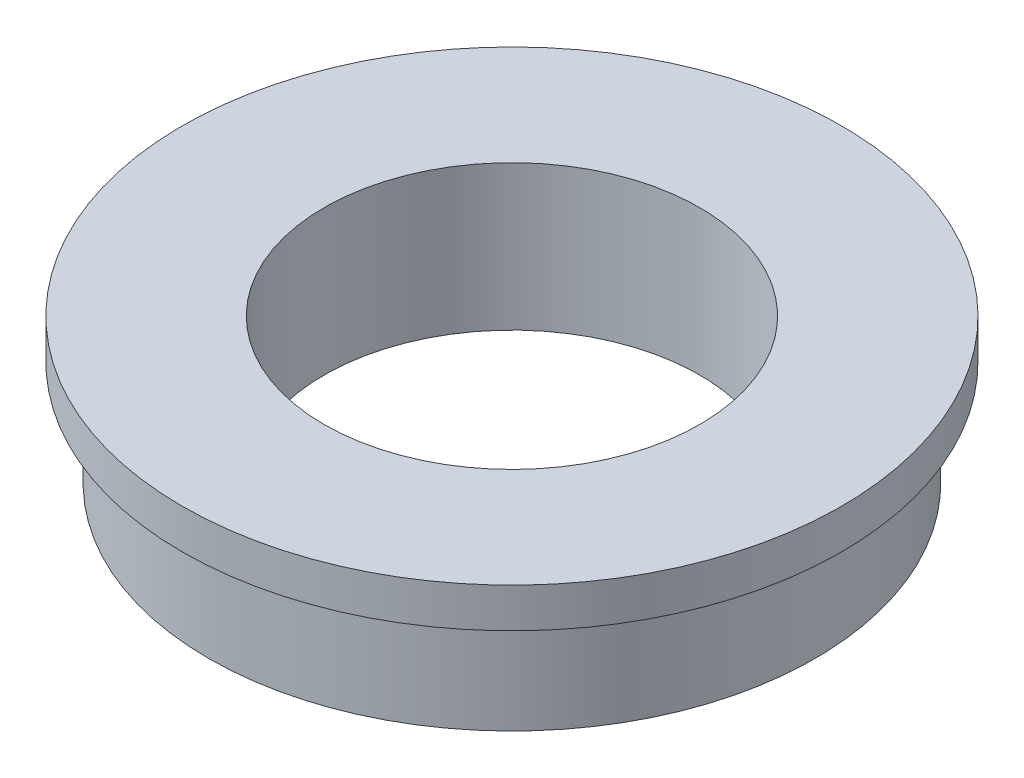
ISO-10303-21;
HEADER;
FILE_DESCRIPTION(('STEP AP214'),'2;1');
FILE_NAME('part.step','',(''),(''),'','','');
FILE_SCHEMA(('AUTOMOTIVE_DESIGN { 1 0 10303 214 1 1 1 1 }'));
ENDSEC;
DATA;
#1=APPLICATION_CONTEXT('core data for automotive mechanical design processes');
#2=APPLICATION_PROTOCOL_DEFINITION('international standard','automotive_design',2000,#1);
#3=PRODUCT_CONTEXT('',#1,'mechanical');
#4=PRODUCT('Part','Part','',(#3));
#5=PRODUCT_RELATED_PRODUCT_CATEGORY('part','',(#4));
#6=PRODUCT_DEFINITION_FORMATION('','',#4);
#7=PRODUCT_DEFINITION_CONTEXT('part definition',#1,'design');
#8=PRODUCT_DEFINITION('design','',#6,#7);
#9=PRODUCT_DEFINITION_SHAPE('','',#8);
#10=(LENGTH_UNIT() NAMED_UNIT(*) SI_UNIT(.MILLI.,.METRE.));
#11=(NAMED_UNIT(*) PLANE_ANGLE_UNIT() SI_UNIT($,.RADIAN.));
#12=(NAMED_UNIT(*) SI_UNIT($,.STERADIAN.) SOLID_ANGLE_UNIT());
#13=UNCERTAINTY_MEASURE_WITH_UNIT(LENGTH_MEASURE(1.E-05),#10,'distance_accuracy_value','');
#14=(GEOMETRIC_REPRESENTATION_CONTEXT(3) GLOBAL_UNCERTAINTY_ASSIGNED_CONTEXT((#13)) GLOBAL_UNIT_ASSIGNED_CONTEXT((#10,
#11,#12)) REPRESENTATION_CONTEXT('',''));
#15=CARTESIAN_POINT('',(0.,0.,0.));
#16=DIRECTION('',(0.,0.,1.));
#17=DIRECTION('',(1.,0.,0.));
#18=AXIS2_PLACEMENT_3D('',#15,#16,#17);
#19=CARTESIAN_POINT('',(-23.,-8.,0.));
#20=DIRECTION('',(0.,-1.,0.));
#21=DIRECTION('',(0.,0.,-1.));
#22=AXIS2_PLACEMENT_3D('',#19,#20,#21);
#23=PLANE('',#22);
#24=CARTESIAN_POINT('',(0.,-8.,0.));
#25=DIRECTION('',(0.,1.,0.));
#26=DIRECTION('',(0.,0.,1.));
#27=AXIS2_PLACEMENT_3D('',#24,#25,#26);
#28=CIRCLE('',#27,14.25);
#29=CARTESIAN_POINT('',(0.,-8.,14.25));
#30=VERTEX_POINT('',#29);
#31=EDGE_CURVE('E10',#30,#30,#28,.T.);
#32=ORIENTED_EDGE('',*,*,#31,.T.);
#33=EDGE_LOOP('',(#32));
#34=FACE_BOUND('',#33,.T.);
#35=CARTESIAN_POINT('',(0.,-8.,0.));
#36=DIRECTION('',(0.,1.,0.));
#37=DIRECTION('',(0.,0.,1.));
#38=AXIS2_PLACEMENT_3D('',#35,#36,#37);
#39=CIRCLE('',#38,23.);
#40=CARTESIAN_POINT('',(0.,-8.,23.));
#41=VERTEX_POINT('',#40);
#42=EDGE_CURVE('E46',#41,#41,#39,.T.);
#43=ORIENTED_EDGE('',*,*,#42,.F.);
#44=EDGE_LOOP('',(#43));
#45=FACE_BOUND('',#44,.T.);
#46=ADVANCED_FACE('F24',(#34,#45),#23,.T.);
#47=CARTESIAN_POINT('',(0.,27.6062610229277,0.));
#48=DIRECTION('',(0.,1.,0.));
#49=DIRECTION('',(0.,0.,1.));
#50=AXIS2_PLACEMENT_3D('',#47,#48,#49);
#51=CYLINDRICAL_SURFACE('',#50,14.25);
#52=CARTESIAN_POINT('',(0.,3.,0.));
#53=DIRECTION('',(0.,1.,0.));
#54=DIRECTION('',(0.,0.,1.));
#55=AXIS2_PLACEMENT_3D('',#52,#53,#54);
#56=CIRCLE('',#55,14.25);
#57=CARTESIAN_POINT('',(0.,3.,14.25));
#58=VERTEX_POINT('',#57);
#59=EDGE_CURVE('E30',#58,#58,#56,.T.);
#60=ORIENTED_EDGE('',*,*,#59,.T.);
#61=EDGE_LOOP('',(#60));
#62=FACE_BOUND('',#61,.T.);
#63=ORIENTED_EDGE('',*,*,#31,.F.);
#64=EDGE_LOOP('',(#63));
#65=FACE_BOUND('',#64,.T.);
#66=ADVANCED_FACE('F54',(#62,#65),#51,.F.);
#67=CARTESIAN_POINT('',(-14.25,3.,0.));
#68=DIRECTION('',(0.,1.,0.));
#69=DIRECTION('',(0.,0.,1.));
#70=AXIS2_PLACEMENT_3D('',#67,#68,#69);
#71=PLANE('',#70);
#72=CARTESIAN_POINT('',(0.,3.,0.));
#73=DIRECTION('',(0.,1.,0.));
#74=DIRECTION('',(0.,0.,1.));
#75=AXIS2_PLACEMENT_3D('',#72,#73,#74);
#76=CIRCLE('',#75,25.);
#77=CARTESIAN_POINT('',(0.,3.,25.));
#78=VERTEX_POINT('',#77);
#79=EDGE_CURVE('E34',#78,#78,#76,.T.);
#80=ORIENTED_EDGE('',*,*,#79,.T.);
#81=EDGE_LOOP('',(#80));
#82=FACE_BOUND('',#81,.T.);
#83=ORIENTED_EDGE('',*,*,#59,.F.);
#84=EDGE_LOOP('',(#83));
#85=FACE_BOUND('',#84,.T.);
#86=ADVANCED_FACE('F58',(#82,#85),#71,.T.);
#87=CARTESIAN_POINT('',(0.,27.6062610229277,0.));
#88=DIRECTION('',(0.,1.,0.));
#89=DIRECTION('',(0.,0.,1.));
#90=AXIS2_PLACEMENT_3D('',#87,#88,#89);
#91=CYLINDRICAL_SURFACE('',#90,25.);
#92=CARTESIAN_POINT('',(0.,0.,0.));
#93=DIRECTION('',(0.,1.,0.));
#94=DIRECTION('',(0.,0.,1.));
#95=AXIS2_PLACEMENT_3D('',#92,#93,#94);
#96=CIRCLE('',#95,25.);
#97=CARTESIAN_POINT('',(0.,0.,25.));
#98=VERTEX_POINT('',#97);
#99=EDGE_CURVE('E38',#98,#98,#96,.T.);
#100=ORIENTED_EDGE('',*,*,#99,.T.);
#101=EDGE_LOOP('',(#100));
#102=FACE_BOUND('',#101,.T.);
#103=ORIENTED_EDGE('',*,*,#79,.F.);
#104=EDGE_LOOP('',(#103));
#105=FACE_BOUND('',#104,.T.);
#106=ADVANCED_FACE('F62',(#102,#105),#91,.T.);
#107=CARTESIAN_POINT('',(-25.,0.,0.));
#108=DIRECTION('',(0.,-1.,0.));
#109=DIRECTION('',(0.,0.,-1.));
#110=AXIS2_PLACEMENT_3D('',#107,#108,#109);
#111=PLANE('',#110);
#112=CARTESIAN_POINT('',(0.,0.,0.));
#113=DIRECTION('',(0.,1.,0.));
#114=DIRECTION('',(0.,0.,1.));
#115=AXIS2_PLACEMENT_3D('',#112,#113,#114);
#116=CIRCLE('',#115,23.);
#117=CARTESIAN_POINT('',(0.,0.,23.));
#118=VERTEX_POINT('',#117);
#119=EDGE_CURVE('E43',#118,#118,#116,.T.);
#120=ORIENTED_EDGE('',*,*,#119,.T.);
#121=EDGE_LOOP('',(#120));
#122=FACE_BOUND('',#121,.T.);
#123=ORIENTED_EDGE('',*,*,#99,.F.);
#124=EDGE_LOOP('',(#123));
#125=FACE_BOUND('',#124,.T.);
#126=ADVANCED_FACE('F69',(#122,#125),#111,.T.);
#127=CARTESIAN_POINT('',(0.,27.6062610229277,0.));
#128=DIRECTION('',(0.,1.,0.));
#129=DIRECTION('',(0.,0.,1.));
#130=AXIS2_PLACEMENT_3D('',#127,#128,#129);
#131=CYLINDRICAL_SURFACE('',#130,23.);
#132=ORIENTED_EDGE('',*,*,#42,.T.);
#133=EDGE_LOOP('',(#132));
#134=FACE_BOUND('',#133,.T.);
#135=ORIENTED_EDGE('',*,*,#119,.F.);
#136=EDGE_LOOP('',(#135));
#137=FACE_BOUND('',#136,.T.);
#138=ADVANCED_FACE('F50',(#134,#137),#131,.T.);
#139=CLOSED_SHELL('',(#46,#66,#86,#106,#126,#138));
#140=MANIFOLD_SOLID_BREP('B2',#139);
#141=ADVANCED_BREP_SHAPE_REPRESENTATION('',(#18,#140),#14);
#142=SHAPE_DEFINITION_REPRESENTATION(#9,#141);
ENDSEC;
END-ISO-10303-21;
